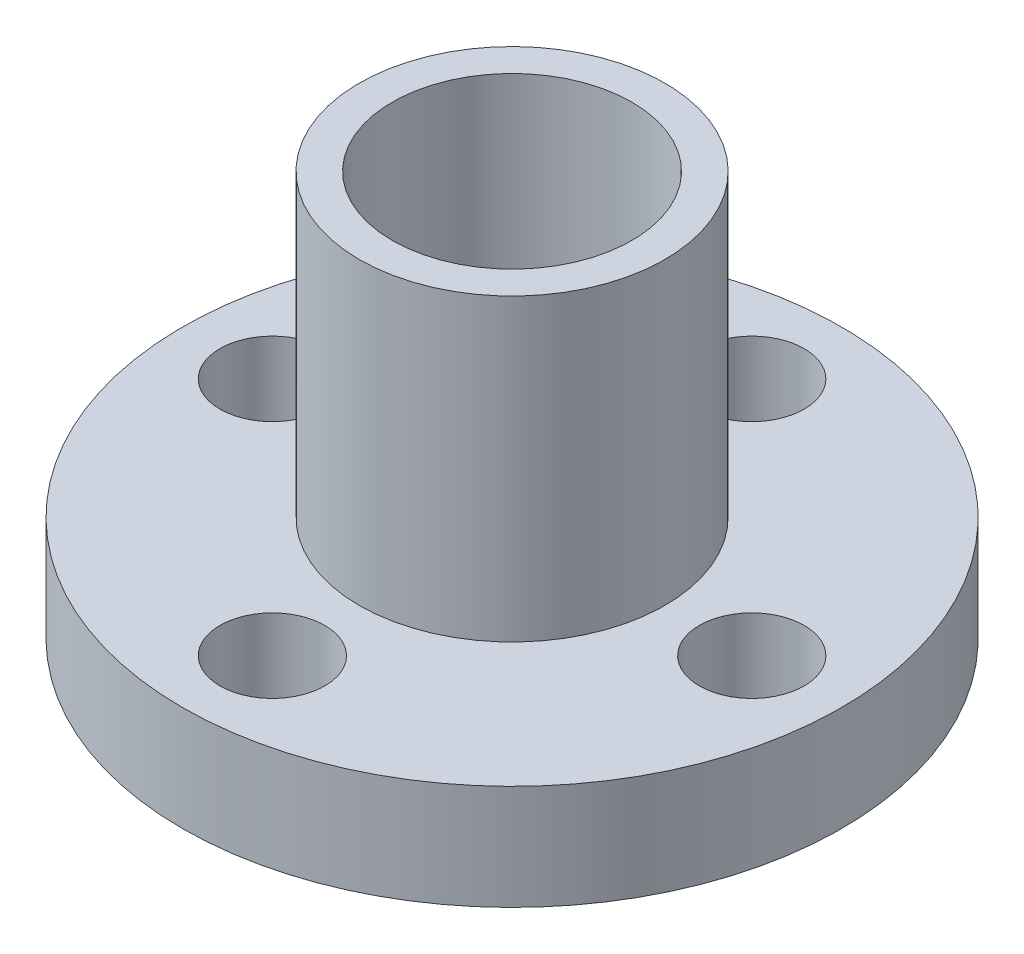
ISO-10303-21;
HEADER;
FILE_DESCRIPTION(('STEP AP214'),'2;1');
FILE_NAME('part.step','',(''),(''),'','','');
FILE_SCHEMA(('AUTOMOTIVE_DESIGN { 1 0 10303 214 1 1 1 1 }'));
ENDSEC;
DATA;
#1=APPLICATION_CONTEXT('core data for automotive mechanical design processes');
#2=APPLICATION_PROTOCOL_DEFINITION('international standard','automotive_design',2000,#1);
#3=PRODUCT_CONTEXT('',#1,'mechanical');
#4=PRODUCT('Part','Part','',(#3));
#5=PRODUCT_RELATED_PRODUCT_CATEGORY('part','',(#4));
#6=PRODUCT_DEFINITION_FORMATION('','',#4);
#7=PRODUCT_DEFINITION_CONTEXT('part definition',#1,'design');
#8=PRODUCT_DEFINITION('design','',#6,#7);
#9=PRODUCT_DEFINITION_SHAPE('','',#8);
#10=(LENGTH_UNIT() NAMED_UNIT(*) SI_UNIT(.MILLI.,.METRE.));
#11=(NAMED_UNIT(*) PLANE_ANGLE_UNIT() SI_UNIT($,.RADIAN.));
#12=(NAMED_UNIT(*) SI_UNIT($,.STERADIAN.) SOLID_ANGLE_UNIT());
#13=UNCERTAINTY_MEASURE_WITH_UNIT(LENGTH_MEASURE(1.E-05),#10,'distance_accuracy_value','');
#14=(GEOMETRIC_REPRESENTATION_CONTEXT(3) GLOBAL_UNCERTAINTY_ASSIGNED_CONTEXT((#13)) GLOBAL_UNIT_ASSIGNED_CONTEXT((#10,
#11,#12)) REPRESENTATION_CONTEXT('',''));
#15=CARTESIAN_POINT('',(0.,0.,0.));
#16=DIRECTION('',(0.,0.,1.));
#17=DIRECTION('',(1.,0.,0.));
#18=AXIS2_PLACEMENT_3D('',#15,#16,#17);
#19=CARTESIAN_POINT('',(0.,-5.,0.));
#20=DIRECTION('',(0.,1.,0.));
#21=DIRECTION('',(0.,0.,1.));
#22=AXIS2_PLACEMENT_3D('',#19,#20,#21);
#23=CYLINDRICAL_SURFACE('',#22,5.1);
#24=CARTESIAN_POINT('',(0.,-5.,0.));
#25=DIRECTION('',(0.,1.,0.));
#26=DIRECTION('',(0.,0.,1.));
#27=AXIS2_PLACEMENT_3D('',#24,#25,#26);
#28=CIRCLE('',#27,5.1);
#29=CARTESIAN_POINT('',(0.,-5.,5.1));
#30=VERTEX_POINT('',#29);
#31=EDGE_CURVE('E41',#30,#30,#28,.T.);
#32=ORIENTED_EDGE('',*,*,#31,.T.);
#33=EDGE_LOOP('',(#32));
#34=FACE_BOUND('',#33,.T.);
#35=CARTESIAN_POINT('',(0.,-3.5,0.));
#36=DIRECTION('',(0.,1.,0.));
#37=DIRECTION('',(0.,0.,1.));
#38=AXIS2_PLACEMENT_3D('',#35,#36,#37);
#39=CIRCLE('',#38,5.1);
#40=CARTESIAN_POINT('',(0.,-3.5,5.1));
#41=VERTEX_POINT('',#40);
#42=EDGE_CURVE('E37',#41,#41,#39,.F.);
#43=ORIENTED_EDGE('',*,*,#42,.T.);
#44=EDGE_LOOP('',(#43));
#45=FACE_BOUND('',#44,.T.);
#46=ADVANCED_FACE('F33',(#34,#45),#23,.T.);
#47=CARTESIAN_POINT('',(0.,-5.,0.));
#48=DIRECTION('',(0.,1.,0.));
#49=DIRECTION('',(0.,0.,1.));
#50=AXIS2_PLACEMENT_3D('',#47,#48,#49);
#51=PLANE('',#50);
#52=CARTESIAN_POINT('',(0.,-5.,0.));
#53=DIRECTION('',(0.,1.,0.));
#54=DIRECTION('',(0.,0.,1.));
#55=AXIS2_PLACEMENT_3D('',#52,#53,#54);
#56=CIRCLE('',#55,4.);
#57=CARTESIAN_POINT('',(0.,-5.,4.));
#58=VERTEX_POINT('',#57);
#59=EDGE_CURVE('E76',#58,#58,#56,.T.);
#60=ORIENTED_EDGE('',*,*,#59,.T.);
#61=EDGE_LOOP('',(#60));
#62=FACE_BOUND('',#61,.T.);
#63=ORIENTED_EDGE('',*,*,#31,.F.);
#64=EDGE_LOOP('',(#63));
#65=FACE_BOUND('',#64,.T.);
#66=ADVANCED_FACE('F107',(#62,#65),#51,.F.);
#67=CARTESIAN_POINT('',(0.,-3.5,0.));
#68=DIRECTION('',(0.,1.,0.));
#69=DIRECTION('',(0.,0.,1.));
#70=AXIS2_PLACEMENT_3D('',#67,#68,#69);
#71=CYLINDRICAL_SURFACE('',#70,11.);
#72=CARTESIAN_POINT('',(0.,-3.5,0.));
#73=DIRECTION('',(0.,1.,0.));
#74=DIRECTION('',(0.,0.,1.));
#75=AXIS2_PLACEMENT_3D('',#72,#73,#74);
#76=CIRCLE('',#75,11.);
#77=CARTESIAN_POINT('',(0.,-3.5,11.));
#78=VERTEX_POINT('',#77);
#79=EDGE_CURVE('E53',#78,#78,#76,.T.);
#80=ORIENTED_EDGE('',*,*,#79,.T.);
#81=EDGE_LOOP('',(#80));
#82=FACE_BOUND('',#81,.T.);
#83=CARTESIAN_POINT('',(0.,0.,0.));
#84=DIRECTION('',(0.,1.,0.));
#85=DIRECTION('',(0.,0.,1.));
#86=AXIS2_PLACEMENT_3D('',#83,#84,#85);
#87=CIRCLE('',#86,11.);
#88=CARTESIAN_POINT('',(0.,0.,11.));
#89=VERTEX_POINT('',#88);
#90=EDGE_CURVE('E50',#89,#89,#87,.T.);
#91=ORIENTED_EDGE('',*,*,#90,.F.);
#92=EDGE_LOOP('',(#91));
#93=FACE_BOUND('',#92,.T.);
#94=ADVANCED_FACE('F112',(#82,#93),#71,.T.);
#95=CARTESIAN_POINT('',(0.,-3.5,0.));
#96=DIRECTION('',(0.,1.,0.));
#97=DIRECTION('',(0.,0.,1.));
#98=AXIS2_PLACEMENT_3D('',#95,#96,#97);
#99=PLANE('',#98);
#100=CARTESIAN_POINT('',(0.,-3.5,-8.));
#101=DIRECTION('',(0.,1.,0.));
#102=DIRECTION('',(0.,0.,1.));
#103=AXIS2_PLACEMENT_3D('',#100,#101,#102);
#104=CIRCLE('',#103,1.75);
#105=CARTESIAN_POINT('',(0.,-3.5,-6.25));
#106=VERTEX_POINT('',#105);
#107=EDGE_CURVE('E62',#106,#106,#104,.T.);
#108=ORIENTED_EDGE('',*,*,#107,.T.);
#109=EDGE_LOOP('',(#108));
#110=FACE_BOUND('',#109,.T.);
#111=CARTESIAN_POINT('',(8.,-3.5,0.));
#112=DIRECTION('',(0.,1.,0.));
#113=DIRECTION('',(0.,0.,1.));
#114=AXIS2_PLACEMENT_3D('',#111,#112,#113);
#115=CIRCLE('',#114,1.75);
#116=CARTESIAN_POINT('',(8.,-3.5,1.75));
#117=VERTEX_POINT('',#116);
#118=EDGE_CURVE('E65',#117,#117,#115,.T.);
#119=ORIENTED_EDGE('',*,*,#118,.T.);
#120=EDGE_LOOP('',(#119));
#121=FACE_BOUND('',#120,.T.);
#122=CARTESIAN_POINT('',(0.,-3.5,8.));
#123=DIRECTION('',(0.,1.,0.));
#124=DIRECTION('',(0.,0.,1.));
#125=AXIS2_PLACEMENT_3D('',#122,#123,#124);
#126=CIRCLE('',#125,1.75);
#127=CARTESIAN_POINT('',(0.,-3.5,9.75));
#128=VERTEX_POINT('',#127);
#129=EDGE_CURVE('E68',#128,#128,#126,.T.);
#130=ORIENTED_EDGE('',*,*,#129,.T.);
#131=EDGE_LOOP('',(#130));
#132=FACE_BOUND('',#131,.T.);
#133=CARTESIAN_POINT('',(-8.,-3.5,0.));
#134=DIRECTION('',(0.,1.,0.));
#135=DIRECTION('',(0.,0.,1.));
#136=AXIS2_PLACEMENT_3D('',#133,#134,#135);
#137=CIRCLE('',#136,1.75);
#138=CARTESIAN_POINT('',(-8.,-3.5,1.75));
#139=VERTEX_POINT('',#138);
#140=EDGE_CURVE('E54',#139,#139,#137,.T.);
#141=ORIENTED_EDGE('',*,*,#140,.T.);
#142=EDGE_LOOP('',(#141));
#143=FACE_BOUND('',#142,.T.);
#144=ORIENTED_EDGE('',*,*,#42,.F.);
#145=EDGE_LOOP('',(#144));
#146=FACE_BOUND('',#145,.T.);
#147=ORIENTED_EDGE('',*,*,#79,.F.);
#148=EDGE_LOOP('',(#147));
#149=FACE_BOUND('',#148,.T.);
#150=ADVANCED_FACE('F119',(#110,#121,#132,#143,#146,#149),#99,.F.);
#151=CARTESIAN_POINT('',(0.,0.,0.));
#152=DIRECTION('',(0.,1.,0.));
#153=DIRECTION('',(0.,0.,1.));
#154=AXIS2_PLACEMENT_3D('',#151,#152,#153);
#155=PLANE('',#154);
#156=CARTESIAN_POINT('',(0.,0.,-8.));
#157=DIRECTION('',(0.,1.,0.));
#158=DIRECTION('',(0.,0.,1.));
#159=AXIS2_PLACEMENT_3D('',#156,#157,#158);
#160=CIRCLE('',#159,1.75);
#161=CARTESIAN_POINT('',(0.,0.,-6.25));
#162=VERTEX_POINT('',#161);
#163=EDGE_CURVE('E71',#162,#162,#160,.T.);
#164=ORIENTED_EDGE('',*,*,#163,.F.);
#165=EDGE_LOOP('',(#164));
#166=FACE_BOUND('',#165,.T.);
#167=CARTESIAN_POINT('',(8.,0.,0.));
#168=DIRECTION('',(0.,1.,0.));
#169=DIRECTION('',(0.,0.,1.));
#170=AXIS2_PLACEMENT_3D('',#167,#168,#169);
#171=CIRCLE('',#170,1.75);
#172=CARTESIAN_POINT('',(8.,0.,1.75));
#173=VERTEX_POINT('',#172);
#174=EDGE_CURVE('E75',#173,#173,#171,.T.);
#175=ORIENTED_EDGE('',*,*,#174,.F.);
#176=EDGE_LOOP('',(#175));
#177=FACE_BOUND('',#176,.T.);
#178=CARTESIAN_POINT('',(0.,0.,8.));
#179=DIRECTION('',(0.,1.,0.));
#180=DIRECTION('',(0.,0.,1.));
#181=AXIS2_PLACEMENT_3D('',#178,#179,#180);
#182=CIRCLE('',#181,1.75);
#183=CARTESIAN_POINT('',(0.,0.,9.75));
#184=VERTEX_POINT('',#183);
#185=EDGE_CURVE('E72',#184,#184,#182,.T.);
#186=ORIENTED_EDGE('',*,*,#185,.F.);
#187=EDGE_LOOP('',(#186));
#188=FACE_BOUND('',#187,.T.);
#189=CARTESIAN_POINT('',(-8.,0.,0.));
#190=DIRECTION('',(0.,1.,0.));
#191=DIRECTION('',(0.,0.,1.));
#192=AXIS2_PLACEMENT_3D('',#189,#190,#191);
#193=CIRCLE('',#192,1.75);
#194=CARTESIAN_POINT('',(-8.,0.,1.75));
#195=VERTEX_POINT('',#194);
#196=EDGE_CURVE('E59',#195,#195,#193,.T.);
#197=ORIENTED_EDGE('',*,*,#196,.F.);
#198=EDGE_LOOP('',(#197));
#199=FACE_BOUND('',#198,.T.);
#200=CARTESIAN_POINT('',(0.,0.,0.));
#201=DIRECTION('',(0.,1.,0.));
#202=DIRECTION('',(0.,0.,1.));
#203=AXIS2_PLACEMENT_3D('',#200,#201,#202);
#204=CIRCLE('',#203,5.1);
#205=CARTESIAN_POINT('',(0.,0.,5.1));
#206=VERTEX_POINT('',#205);
#207=EDGE_CURVE('E10',#206,#206,#204,.F.);
#208=ORIENTED_EDGE('',*,*,#207,.T.);
#209=EDGE_LOOP('',(#208));
#210=FACE_BOUND('',#209,.T.);
#211=ORIENTED_EDGE('',*,*,#90,.T.);
#212=EDGE_LOOP('',(#211));
#213=FACE_BOUND('',#212,.T.);
#214=ADVANCED_FACE('F93',(#166,#177,#188,#199,#210,#213),#155,.T.);
#215=CARTESIAN_POINT('',(0.,10.,0.));
#216=DIRECTION('',(0.,1.,0.));
#217=DIRECTION('',(0.,0.,1.));
#218=AXIS2_PLACEMENT_3D('',#215,#216,#217);
#219=PLANE('',#218);
#220=CARTESIAN_POINT('',(0.,10.,0.));
#221=DIRECTION('',(0.,1.,0.));
#222=DIRECTION('',(0.,0.,1.));
#223=AXIS2_PLACEMENT_3D('',#220,#221,#222);
#224=CIRCLE('',#223,4.);
#225=CARTESIAN_POINT('',(0.,10.,4.));
#226=VERTEX_POINT('',#225);
#227=EDGE_CURVE('E83',#226,#226,#224,.T.);
#228=ORIENTED_EDGE('',*,*,#227,.F.);
#229=EDGE_LOOP('',(#228));
#230=FACE_BOUND('',#229,.T.);
#231=CARTESIAN_POINT('',(0.,10.,0.));
#232=DIRECTION('',(0.,1.,0.));
#233=DIRECTION('',(0.,0.,1.));
#234=AXIS2_PLACEMENT_3D('',#231,#232,#233);
#235=CIRCLE('',#234,5.1);
#236=CARTESIAN_POINT('',(0.,10.,5.1));
#237=VERTEX_POINT('',#236);
#238=EDGE_CURVE('E45',#237,#237,#235,.T.);
#239=ORIENTED_EDGE('',*,*,#238,.T.);
#240=EDGE_LOOP('',(#239));
#241=FACE_BOUND('',#240,.T.);
#242=ADVANCED_FACE('F90',(#230,#241),#219,.T.);
#243=ORIENTED_EDGE('',*,*,#207,.F.);
#244=EDGE_LOOP('',(#243));
#245=FACE_BOUND('',#244,.T.);
#246=ORIENTED_EDGE('',*,*,#238,.F.);
#247=EDGE_LOOP('',(#246));
#248=FACE_BOUND('',#247,.T.);
#249=ADVANCED_FACE('F35',(#245,#248),#23,.T.);
#250=CARTESIAN_POINT('',(-8.,-5.5,0.));
#251=DIRECTION('',(0.,1.,0.));
#252=DIRECTION('',(0.,0.,1.));
#253=AXIS2_PLACEMENT_3D('',#250,#251,#252);
#254=CYLINDRICAL_SURFACE('',#253,1.75);
#255=ORIENTED_EDGE('',*,*,#196,.T.);
#256=EDGE_LOOP('',(#255));
#257=FACE_BOUND('',#256,.T.);
#258=ORIENTED_EDGE('',*,*,#140,.F.);
#259=EDGE_LOOP('',(#258));
#260=FACE_BOUND('',#259,.T.);
#261=ADVANCED_FACE('F98',(#257,#260),#254,.F.);
#262=CARTESIAN_POINT('',(0.,-5.5,8.));
#263=DIRECTION('',(0.,1.,0.));
#264=DIRECTION('',(0.,0.,1.));
#265=AXIS2_PLACEMENT_3D('',#262,#263,#264);
#266=CYLINDRICAL_SURFACE('',#265,1.75);
#267=ORIENTED_EDGE('',*,*,#185,.T.);
#268=EDGE_LOOP('',(#267));
#269=FACE_BOUND('',#268,.T.);
#270=ORIENTED_EDGE('',*,*,#129,.F.);
#271=EDGE_LOOP('',(#270));
#272=FACE_BOUND('',#271,.T.);
#273=ADVANCED_FACE('F103',(#269,#272),#266,.F.);
#274=CARTESIAN_POINT('',(8.,-5.5,0.));
#275=DIRECTION('',(0.,1.,0.));
#276=DIRECTION('',(0.,0.,1.));
#277=AXIS2_PLACEMENT_3D('',#274,#275,#276);
#278=CYLINDRICAL_SURFACE('',#277,1.75);
#279=ORIENTED_EDGE('',*,*,#174,.T.);
#280=EDGE_LOOP('',(#279));
#281=FACE_BOUND('',#280,.T.);
#282=ORIENTED_EDGE('',*,*,#118,.F.);
#283=EDGE_LOOP('',(#282));
#284=FACE_BOUND('',#283,.T.);
#285=ADVANCED_FACE('F141',(#281,#284),#278,.F.);
#286=CARTESIAN_POINT('',(0.,-5.5,-8.));
#287=DIRECTION('',(0.,1.,0.));
#288=DIRECTION('',(0.,0.,1.));
#289=AXIS2_PLACEMENT_3D('',#286,#287,#288);
#290=CYLINDRICAL_SURFACE('',#289,1.75);
#291=ORIENTED_EDGE('',*,*,#163,.T.);
#292=EDGE_LOOP('',(#291));
#293=FACE_BOUND('',#292,.T.);
#294=ORIENTED_EDGE('',*,*,#107,.F.);
#295=EDGE_LOOP('',(#294));
#296=FACE_BOUND('',#295,.T.);
#297=ADVANCED_FACE('F145',(#293,#296),#290,.F.);
#298=CARTESIAN_POINT('',(0.,-6.50000000000001,0.));
#299=DIRECTION('',(0.,1.,0.));
#300=DIRECTION('',(0.,0.,1.));
#301=AXIS2_PLACEMENT_3D('',#298,#299,#300);
#302=CYLINDRICAL_SURFACE('',#301,4.);
#303=ORIENTED_EDGE('',*,*,#227,.T.);
#304=EDGE_LOOP('',(#303));
#305=FACE_BOUND('',#304,.T.);
#306=ORIENTED_EDGE('',*,*,#59,.F.);
#307=EDGE_LOOP('',(#306));
#308=FACE_BOUND('',#307,.T.);
#309=ADVANCED_FACE('F87',(#305,#308),#302,.F.);
#310=CLOSED_SHELL('',(#46,#66,#94,#150,#214,#242,#249,#261,#273,#285,#297,#309));
#311=MANIFOLD_SOLID_BREP('B2',#310);
#312=ADVANCED_BREP_SHAPE_REPRESENTATION('',(#18,#311),#14);
#313=SHAPE_DEFINITION_REPRESENTATION(#9,#312);
ENDSEC;
END-ISO-10303-21;
